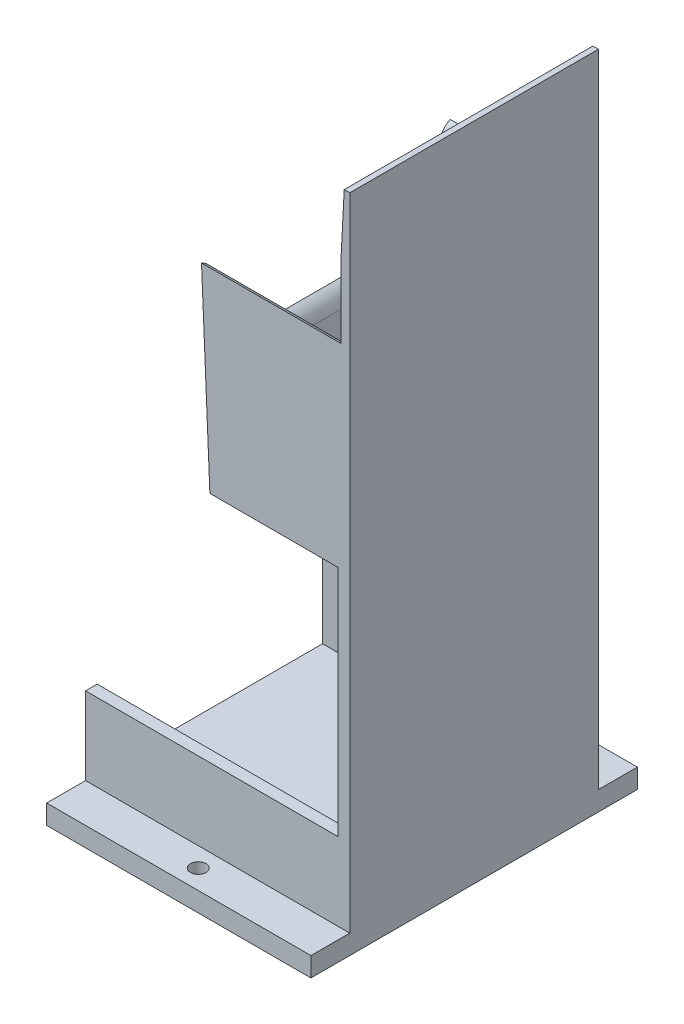
ISO-10303-21;
HEADER;
FILE_DESCRIPTION(('STEP AP214'),'2;1');
FILE_NAME('part.step','',(''),(''),'','','');
FILE_SCHEMA(('AUTOMOTIVE_DESIGN { 1 0 10303 214 1 1 1 1 }'));
ENDSEC;
DATA;
#1=APPLICATION_CONTEXT('core data for automotive mechanical design processes');
#2=APPLICATION_PROTOCOL_DEFINITION('international standard','automotive_design',2000,#1);
#3=PRODUCT_CONTEXT('',#1,'mechanical');
#4=PRODUCT('Part','Part','',(#3));
#5=PRODUCT_RELATED_PRODUCT_CATEGORY('part','',(#4));
#6=PRODUCT_DEFINITION_FORMATION('','',#4);
#7=PRODUCT_DEFINITION_CONTEXT('part definition',#1,'design');
#8=PRODUCT_DEFINITION('design','',#6,#7);
#9=PRODUCT_DEFINITION_SHAPE('','',#8);
#10=(LENGTH_UNIT() NAMED_UNIT(*) SI_UNIT(.MILLI.,.METRE.));
#11=(NAMED_UNIT(*) PLANE_ANGLE_UNIT() SI_UNIT($,.RADIAN.));
#12=(NAMED_UNIT(*) SI_UNIT($,.STERADIAN.) SOLID_ANGLE_UNIT());
#13=UNCERTAINTY_MEASURE_WITH_UNIT(LENGTH_MEASURE(1.E-05),#10,'distance_accuracy_value','');
#14=(GEOMETRIC_REPRESENTATION_CONTEXT(3) GLOBAL_UNCERTAINTY_ASSIGNED_CONTEXT((#13)) GLOBAL_UNIT_ASSIGNED_CONTEXT((#10,
#11,#12)) REPRESENTATION_CONTEXT('',''));
#15=CARTESIAN_POINT('',(0.,0.,0.));
#16=DIRECTION('',(0.,0.,1.));
#17=DIRECTION('',(1.,0.,0.));
#18=AXIS2_PLACEMENT_3D('',#15,#16,#17);
#19=CARTESIAN_POINT('',(30.8125,25.,0.));
#20=DIRECTION('',(-1.,0.,0.));
#21=DIRECTION('',(0.,0.,1.));
#22=AXIS2_PLACEMENT_3D('',#19,#20,#21);
#23=PLANE('',#22);
#24=DIRECTION('',(0.,0.,1.));
#25=VECTOR('',#24,1.);
#26=CARTESIAN_POINT('',(30.8125,25.,0.));
#27=LINE('',#26,#25);
#28=CARTESIAN_POINT('',(30.8125,25.,-29.));
#29=VERTEX_POINT('',#28);
#30=CARTESIAN_POINT('',(30.8125,25.,29.));
#31=VERTEX_POINT('',#30);
#32=EDGE_CURVE('E351',#29,#31,#27,.T.);
#33=ORIENTED_EDGE('',*,*,#32,.F.);
#34=DIRECTION('',(0.,-1.,0.));
#35=VECTOR('',#34,1.);
#36=CARTESIAN_POINT('',(30.8125,25.,-29.));
#37=LINE('',#36,#35);
#38=CARTESIAN_POINT('',(30.8125,5.,-29.));
#39=VERTEX_POINT('',#38);
#40=EDGE_CURVE('E399',#29,#39,#37,.T.);
#41=ORIENTED_EDGE('',*,*,#40,.T.);
#42=DIRECTION('',(0.,0.,-1.));
#43=VECTOR('',#42,1.);
#44=CARTESIAN_POINT('',(30.8125,5.,0.));
#45=LINE('',#44,#43);
#46=CARTESIAN_POINT('',(30.8125,5.,29.));
#47=VERTEX_POINT('',#46);
#48=EDGE_CURVE('E361',#47,#39,#45,.T.);
#49=ORIENTED_EDGE('',*,*,#48,.F.);
#50=DIRECTION('',(0.,-1.,0.));
#51=VECTOR('',#50,1.);
#52=CARTESIAN_POINT('',(30.8125,25.,29.));
#53=LINE('',#52,#51);
#54=EDGE_CURVE('E416',#31,#47,#53,.T.);
#55=ORIENTED_EDGE('',*,*,#54,.F.);
#56=EDGE_LOOP('',(#33,#41,#49,#55));
#57=FACE_BOUND('',#56,.T.);
#58=ADVANCED_FACE('F37',(#57),#23,.T.);
#59=CARTESIAN_POINT('',(0.,25.,29.));
#60=DIRECTION('',(0.,0.,-1.));
#61=DIRECTION('',(-1.,0.,0.));
#62=AXIS2_PLACEMENT_3D('',#59,#60,#61);
#63=PLANE('',#62);
#64=ORIENTED_EDGE('',*,*,#54,.T.);
#65=DIRECTION('',(1.,0.,0.));
#66=VECTOR('',#65,1.);
#67=CARTESIAN_POINT('',(0.,5.,29.));
#68=LINE('',#67,#66);
#69=CARTESIAN_POINT('',(-34.,5.,29.));
#70=VERTEX_POINT('',#69);
#71=EDGE_CURVE('E359',#70,#47,#68,.T.);
#72=ORIENTED_EDGE('',*,*,#71,.F.);
#73=DIRECTION('',(0.,1.,0.));
#74=VECTOR('',#73,1.);
#75=CARTESIAN_POINT('',(-34.,25.,29.));
#76=LINE('',#75,#74);
#77=CARTESIAN_POINT('',(-34.,25.,29.));
#78=VERTEX_POINT('',#77);
#79=EDGE_CURVE('E269',#70,#78,#76,.T.);
#80=ORIENTED_EDGE('',*,*,#79,.T.);
#81=DIRECTION('',(1.,0.,0.));
#82=VECTOR('',#81,1.);
#83=CARTESIAN_POINT('',(0.,25.,29.));
#84=LINE('',#83,#82);
#85=EDGE_CURVE('E386',#78,#31,#84,.T.);
#86=ORIENTED_EDGE('',*,*,#85,.T.);
#87=EDGE_LOOP('',(#64,#72,#80,#86));
#88=FACE_BOUND('',#87,.T.);
#89=ADVANCED_FACE('F459',(#88),#63,.T.);
#90=CARTESIAN_POINT('',(0.,25.,-29.));
#91=DIRECTION('',(0.,0.,-1.));
#92=DIRECTION('',(-1.,0.,0.));
#93=AXIS2_PLACEMENT_3D('',#90,#91,#92);
#94=PLANE('',#93);
#95=ORIENTED_EDGE('',*,*,#40,.F.);
#96=DIRECTION('',(1.,0.,0.));
#97=VECTOR('',#96,1.);
#98=CARTESIAN_POINT('',(0.,25.,-29.));
#99=LINE('',#98,#97);
#100=CARTESIAN_POINT('',(-34.,25.,-29.));
#101=VERTEX_POINT('',#100);
#102=EDGE_CURVE('E388',#101,#29,#99,.T.);
#103=ORIENTED_EDGE('',*,*,#102,.F.);
#104=DIRECTION('',(0.,-1.,0.));
#105=VECTOR('',#104,1.);
#106=CARTESIAN_POINT('',(-34.,5.,-29.));
#107=LINE('',#106,#105);
#108=CARTESIAN_POINT('',(-34.,5.,-29.));
#109=VERTEX_POINT('',#108);
#110=EDGE_CURVE('E263',#101,#109,#107,.T.);
#111=ORIENTED_EDGE('',*,*,#110,.T.);
#112=DIRECTION('',(1.,0.,0.));
#113=VECTOR('',#112,1.);
#114=CARTESIAN_POINT('',(0.,5.,-29.));
#115=LINE('',#114,#113);
#116=EDGE_CURVE('E357',#109,#39,#115,.T.);
#117=ORIENTED_EDGE('',*,*,#116,.T.);
#118=EDGE_LOOP('',(#95,#103,#111,#117));
#119=FACE_BOUND('',#118,.T.);
#120=ADVANCED_FACE('F466',(#119),#94,.F.);
#121=CARTESIAN_POINT('',(0.,25.,32.));
#122=DIRECTION('',(0.,0.,-1.));
#123=DIRECTION('',(-1.,0.,0.));
#124=AXIS2_PLACEMENT_3D('',#121,#122,#123);
#125=PLANE('',#124);
#126=DIRECTION('',(0.,1.,0.));
#127=VECTOR('',#126,1.);
#128=CARTESIAN_POINT('',(31.7861166892457,0.,32.));
#129=LINE('',#128,#127);
#130=CARTESIAN_POINT('',(31.7861166892457,135.278959734629,32.));
#131=VERTEX_POINT('',#130);
#132=CARTESIAN_POINT('',(31.7861166892457,155.,32.));
#133=VERTEX_POINT('',#132);
#134=EDGE_CURVE('E224',#131,#133,#129,.T.);
#135=ORIENTED_EDGE('',*,*,#134,.F.);
#136=DIRECTION('',(1.,0.,0.));
#137=VECTOR('',#136,1.);
#138=CARTESIAN_POINT('',(0.,135.278959734629,32.));
#139=LINE('',#138,#137);
#140=CARTESIAN_POINT('',(-4.15481256005554,135.278959734629,32.));
#141=VERTEX_POINT('',#140);
#142=EDGE_CURVE('E235',#141,#131,#139,.T.);
#143=ORIENTED_EDGE('',*,*,#142,.F.);
#144=DIRECTION('',(-0.0428178383921858,0.99908289581767,0.));
#145=VECTOR('',#144,1.);
#146=CARTESIAN_POINT('',(-5.,155.,32.));
#147=LINE('',#146,#145);
#148=CARTESIAN_POINT('',(-2.,85.,32.));
#149=VERTEX_POINT('',#148);
#150=EDGE_CURVE('E377',#149,#141,#147,.T.);
#151=ORIENTED_EDGE('',*,*,#150,.F.);
#152=DIRECTION('',(-1.,0.,0.));
#153=VECTOR('',#152,1.);
#154=CARTESIAN_POINT('',(-2.,85.,32.));
#155=LINE('',#154,#153);
#156=CARTESIAN_POINT('',(31.,85.,32.));
#157=VERTEX_POINT('',#156);
#158=EDGE_CURVE('E374',#157,#149,#155,.T.);
#159=ORIENTED_EDGE('',*,*,#158,.F.);
#160=DIRECTION('',(0.,-1.,0.));
#161=VECTOR('',#160,1.);
#162=CARTESIAN_POINT('',(31.,25.,32.));
#163=LINE('',#162,#161);
#164=CARTESIAN_POINT('',(31.,25.,32.));
#165=VERTEX_POINT('',#164);
#166=EDGE_CURVE('E354',#157,#165,#163,.T.);
#167=ORIENTED_EDGE('',*,*,#166,.T.);
#168=DIRECTION('',(1.,0.,0.));
#169=VECTOR('',#168,1.);
#170=CARTESIAN_POINT('',(0.,25.,32.));
#171=LINE('',#170,#169);
#172=CARTESIAN_POINT('',(-34.,25.,32.));
#173=VERTEX_POINT('',#172);
#174=EDGE_CURVE('E391',#173,#165,#171,.T.);
#175=ORIENTED_EDGE('',*,*,#174,.F.);
#176=DIRECTION('',(0.,-1.,0.));
#177=VECTOR('',#176,1.);
#178=CARTESIAN_POINT('',(-34.,25.,32.));
#179=LINE('',#178,#177);
#180=CARTESIAN_POINT('',(-34.,5.,32.));
#181=VERTEX_POINT('',#180);
#182=EDGE_CURVE('E402',#173,#181,#179,.T.);
#183=ORIENTED_EDGE('',*,*,#182,.T.);
#184=DIRECTION('',(1.,0.,0.));
#185=VECTOR('',#184,1.);
#186=CARTESIAN_POINT('',(0.,5.,32.));
#187=LINE('',#186,#185);
#188=CARTESIAN_POINT('',(34.,5.,32.));
#189=VERTEX_POINT('',#188);
#190=EDGE_CURVE('E284',#181,#189,#187,.T.);
#191=ORIENTED_EDGE('',*,*,#190,.T.);
#192=DIRECTION('',(0.,-1.,0.));
#193=VECTOR('',#192,1.);
#194=CARTESIAN_POINT('',(34.,25.,32.));
#195=LINE('',#194,#193);
#196=CARTESIAN_POINT('',(34.,170.,32.));
#197=VERTEX_POINT('',#196);
#198=EDGE_CURVE('E411',#197,#189,#195,.T.);
#199=ORIENTED_EDGE('',*,*,#198,.F.);
#200=DIRECTION('',(-1.,0.,0.));
#201=VECTOR('',#200,1.);
#202=CARTESIAN_POINT('',(0.,170.,32.));
#203=LINE('',#202,#201);
#204=CARTESIAN_POINT('',(32.5722333784915,170.,32.));
#205=VERTEX_POINT('',#204);
#206=EDGE_CURVE('E278',#197,#205,#203,.T.);
#207=ORIENTED_EDGE('',*,*,#206,.T.);
#208=DIRECTION('',(0.0523359562429511,0.998629534754574,0.));
#209=VECTOR('',#208,1.);
#210=CARTESIAN_POINT('',(32.5722333784915,170.,32.));
#211=LINE('',#210,#209);
#212=EDGE_CURVE('E238',#205,#133,#211,.F.);
#213=ORIENTED_EDGE('',*,*,#212,.T.);
#214=EDGE_LOOP('',(#135,#143,#151,#159,#167,#175,#183,#191,#199,#207,#213));
#215=FACE_BOUND('',#214,.T.);
#216=ADVANCED_FACE('F232',(#215),#125,.F.);
#217=CARTESIAN_POINT('',(34.,25.,0.));
#218=DIRECTION('',(-1.,0.,0.));
#219=DIRECTION('',(0.,0.,1.));
#220=AXIS2_PLACEMENT_3D('',#217,#218,#219);
#221=PLANE('',#220);
#222=DIRECTION('',(0.,-1.,0.));
#223=VECTOR('',#222,1.);
#224=CARTESIAN_POINT('',(34.,25.,-32.));
#225=LINE('',#224,#223);
#226=CARTESIAN_POINT('',(34.,170.,-32.));
#227=VERTEX_POINT('',#226);
#228=CARTESIAN_POINT('',(34.,5.,-32.));
#229=VERTEX_POINT('',#228);
#230=EDGE_CURVE('E409',#227,#229,#225,.T.);
#231=ORIENTED_EDGE('',*,*,#230,.F.);
#232=DIRECTION('',(0.,0.,1.));
#233=VECTOR('',#232,1.);
#234=CARTESIAN_POINT('',(34.,170.,0.));
#235=LINE('',#234,#233);
#236=EDGE_CURVE('E275',#227,#197,#235,.T.);
#237=ORIENTED_EDGE('',*,*,#236,.T.);
#238=ORIENTED_EDGE('',*,*,#198,.T.);
#239=DIRECTION('',(0.,0.,1.));
#240=VECTOR('',#239,1.);
#241=CARTESIAN_POINT('',(34.,5.,0.));
#242=LINE('',#241,#240);
#243=CARTESIAN_POINT('',(34.,5.,42.));
#244=VERTEX_POINT('',#243);
#245=EDGE_CURVE('E281',#189,#244,#242,.T.);
#246=ORIENTED_EDGE('',*,*,#245,.T.);
#247=DIRECTION('',(0.,-1.,0.));
#248=VECTOR('',#247,1.);
#249=CARTESIAN_POINT('',(34.,5.,42.));
#250=LINE('',#249,#248);
#251=CARTESIAN_POINT('',(34.,0.,42.));
#252=VERTEX_POINT('',#251);
#253=EDGE_CURVE('E297',#244,#252,#250,.T.);
#254=ORIENTED_EDGE('',*,*,#253,.T.);
#255=DIRECTION('',(0.,0.,-1.));
#256=VECTOR('',#255,1.);
#257=CARTESIAN_POINT('',(34.,0.,0.));
#258=LINE('',#257,#256);
#259=CARTESIAN_POINT('',(34.,0.,-42.));
#260=VERTEX_POINT('',#259);
#261=EDGE_CURVE('E385',#252,#260,#258,.T.);
#262=ORIENTED_EDGE('',*,*,#261,.T.);
#263=DIRECTION('',(0.,-1.,0.));
#264=VECTOR('',#263,1.);
#265=CARTESIAN_POINT('',(34.,5.,-42.));
#266=LINE('',#265,#264);
#267=CARTESIAN_POINT('',(34.,5.,-42.));
#268=VERTEX_POINT('',#267);
#269=EDGE_CURVE('E323',#268,#260,#266,.T.);
#270=ORIENTED_EDGE('',*,*,#269,.F.);
#271=DIRECTION('',(0.,0.,-1.));
#272=VECTOR('',#271,1.);
#273=CARTESIAN_POINT('',(34.,5.,0.));
#274=LINE('',#273,#272);
#275=EDGE_CURVE('E321',#229,#268,#274,.T.);
#276=ORIENTED_EDGE('',*,*,#275,.F.);
#277=EDGE_LOOP('',(#231,#237,#238,#246,#254,#262,#270,#276));
#278=FACE_BOUND('',#277,.T.);
#279=ADVANCED_FACE('F480',(#278),#221,.F.);
#280=CARTESIAN_POINT('',(0.,25.,-32.));
#281=DIRECTION('',(0.,0.,-1.));
#282=DIRECTION('',(-1.,0.,0.));
#283=AXIS2_PLACEMENT_3D('',#280,#281,#282);
#284=PLANE('',#283);
#285=DIRECTION('',(-1.,0.,0.));
#286=VECTOR('',#285,1.);
#287=CARTESIAN_POINT('',(0.,135.278959734629,-32.));
#288=LINE('',#287,#286);
#289=CARTESIAN_POINT('',(31.7861166892457,135.278959734629,-32.));
#290=VERTEX_POINT('',#289);
#291=CARTESIAN_POINT('',(-4.15481256005554,135.278959734629,-32.));
#292=VERTEX_POINT('',#291);
#293=EDGE_CURVE('E252',#290,#292,#288,.T.);
#294=ORIENTED_EDGE('',*,*,#293,.F.);
#295=DIRECTION('',(0.,-1.,0.));
#296=VECTOR('',#295,1.);
#297=CARTESIAN_POINT('',(31.7861166892457,25.,-32.));
#298=LINE('',#297,#296);
#299=CARTESIAN_POINT('',(31.7861166892457,155.,-32.));
#300=VERTEX_POINT('',#299);
#301=EDGE_CURVE('E227',#300,#290,#298,.T.);
#302=ORIENTED_EDGE('',*,*,#301,.F.);
#303=DIRECTION('',(-0.0523359562429511,-0.998629534754574,0.));
#304=VECTOR('',#303,1.);
#305=CARTESIAN_POINT('',(24.9047027403173,23.6947998356755,-32.));
#306=LINE('',#305,#304);
#307=CARTESIAN_POINT('',(32.5722333784915,170.,-32.));
#308=VERTEX_POINT('',#307);
#309=EDGE_CURVE('E429',#300,#308,#306,.F.);
#310=ORIENTED_EDGE('',*,*,#309,.T.);
#311=DIRECTION('',(-1.,0.,0.));
#312=VECTOR('',#311,1.);
#313=CARTESIAN_POINT('',(36.,170.,-32.));
#314=LINE('',#313,#312);
#315=EDGE_CURVE('E272',#227,#308,#314,.T.);
#316=ORIENTED_EDGE('',*,*,#315,.F.);
#317=ORIENTED_EDGE('',*,*,#230,.T.);
#318=DIRECTION('',(1.,0.,0.));
#319=VECTOR('',#318,1.);
#320=CARTESIAN_POINT('',(0.,5.,-32.));
#321=LINE('',#320,#319);
#322=CARTESIAN_POINT('',(-34.,5.,-32.));
#323=VERTEX_POINT('',#322);
#324=EDGE_CURVE('E318',#323,#229,#321,.T.);
#325=ORIENTED_EDGE('',*,*,#324,.F.);
#326=DIRECTION('',(0.,-1.,0.));
#327=VECTOR('',#326,1.);
#328=CARTESIAN_POINT('',(-34.,25.,-32.));
#329=LINE('',#328,#327);
#330=CARTESIAN_POINT('',(-34.,25.,-32.));
#331=VERTEX_POINT('',#330);
#332=EDGE_CURVE('E405',#331,#323,#329,.T.);
#333=ORIENTED_EDGE('',*,*,#332,.F.);
#334=DIRECTION('',(1.,0.,0.));
#335=VECTOR('',#334,1.);
#336=CARTESIAN_POINT('',(0.,25.,-32.));
#337=LINE('',#336,#335);
#338=CARTESIAN_POINT('',(31.,25.,-32.));
#339=VERTEX_POINT('',#338);
#340=EDGE_CURVE('E393',#331,#339,#337,.T.);
#341=ORIENTED_EDGE('',*,*,#340,.T.);
#342=DIRECTION('',(0.,-1.,0.));
#343=VECTOR('',#342,1.);
#344=CARTESIAN_POINT('',(31.,25.,-32.));
#345=LINE('',#344,#343);
#346=CARTESIAN_POINT('',(31.,85.,-32.));
#347=VERTEX_POINT('',#346);
#348=EDGE_CURVE('E333',#347,#339,#345,.T.);
#349=ORIENTED_EDGE('',*,*,#348,.F.);
#350=DIRECTION('',(1.,0.,0.));
#351=VECTOR('',#350,1.);
#352=CARTESIAN_POINT('',(0.,85.,-32.));
#353=LINE('',#352,#351);
#354=CARTESIAN_POINT('',(-2.,85.,-32.));
#355=VERTEX_POINT('',#354);
#356=EDGE_CURVE('E365',#355,#347,#353,.T.);
#357=ORIENTED_EDGE('',*,*,#356,.F.);
#358=DIRECTION('',(0.0428178383921858,-0.99908289581767,0.));
#359=VECTOR('',#358,1.);
#360=CARTESIAN_POINT('',(1.63984518231819,0.0702790792422083,-32.));
#361=LINE('',#360,#359);
#362=EDGE_CURVE('E367',#292,#355,#361,.T.);
#363=ORIENTED_EDGE('',*,*,#362,.F.);
#364=EDGE_LOOP('',(#294,#302,#310,#316,#317,#325,#333,#341,#349,#357,#363));
#365=FACE_BOUND('',#364,.T.);
#366=ADVANCED_FACE('F473',(#365),#284,.T.);
#367=CARTESIAN_POINT('',(30.8125,130.696384039674,34.));
#368=DIRECTION('',(-1.,0.,0.));
#369=DIRECTION('',(0.,0.,1.));
#370=AXIS2_PLACEMENT_3D('',#367,#368,#369);
#371=CIRCLE('',#370,5.);
#372=CARTESIAN_POINT('',(30.8125,130.696384039674,29.));
#373=VERTEX_POINT('',#372);
#374=CARTESIAN_POINT('',(30.8125,132.314463582687,29.269057325175));
#375=VERTEX_POINT('',#374);
#376=EDGE_CURVE('E52',#373,#375,#371,.F.);
#377=ORIENTED_EDGE('',*,*,#376,.T.);
#378=DIRECTION('',(0.,0.,-1.));
#379=VECTOR('',#378,1.);
#380=CARTESIAN_POINT('',(30.8125,132.314463582687,-29.));
#381=LINE('',#380,#379);
#382=CARTESIAN_POINT('',(30.8125,132.314463582687,-29.269057325175));
#383=VERTEX_POINT('',#382);
#384=EDGE_CURVE('E59',#375,#383,#381,.T.);
#385=ORIENTED_EDGE('',*,*,#384,.T.);
#386=CARTESIAN_POINT('',(30.8125,130.696384039674,-34.));
#387=DIRECTION('',(-1.,0.,0.));
#388=DIRECTION('',(0.,0.,1.));
#389=AXIS2_PLACEMENT_3D('',#386,#387,#388);
#390=CIRCLE('',#389,5.);
#391=CARTESIAN_POINT('',(30.8125,130.696384039674,-29.));
#392=VERTEX_POINT('',#391);
#393=EDGE_CURVE('E11',#383,#392,#390,.F.);
#394=ORIENTED_EDGE('',*,*,#393,.T.);
#395=CARTESIAN_POINT('',(30.8125,85.,-29.));
#396=VERTEX_POINT('',#395);
#397=EDGE_CURVE('E414',#392,#396,#37,.T.);
#398=ORIENTED_EDGE('',*,*,#397,.T.);
#399=DIRECTION('',(0.,0.,-1.));
#400=VECTOR('',#399,1.);
#401=CARTESIAN_POINT('',(30.8125,85.,0.));
#402=LINE('',#401,#400);
#403=CARTESIAN_POINT('',(30.8125,85.,29.));
#404=VERTEX_POINT('',#403);
#405=EDGE_CURVE('E345',#404,#396,#402,.T.);
#406=ORIENTED_EDGE('',*,*,#405,.F.);
#407=EDGE_CURVE('E406',#373,#404,#53,.T.);
#408=ORIENTED_EDGE('',*,*,#407,.F.);
#409=EDGE_LOOP('',(#377,#385,#394,#398,#406,#408));
#410=FACE_BOUND('',#409,.T.);
#411=ADVANCED_FACE('F462',(#410),#23,.T.);
#412=DIRECTION('',(-0.0428178383921859,0.99908289581767,0.));
#413=VECTOR('',#412,1.);
#414=CARTESIAN_POINT('',(-5.,155.,29.));
#415=LINE('',#414,#413);
#416=CARTESIAN_POINT('',(-3.28728646431256,115.036684167293,29.));
#417=VERTEX_POINT('',#416);
#418=CARTESIAN_POINT('',(-3.95841645884315,130.696384039674,29.));
#419=VERTEX_POINT('',#418);
#420=EDGE_CURVE('E260',#417,#419,#415,.T.);
#421=ORIENTED_EDGE('',*,*,#420,.T.);
#422=DIRECTION('',(-1.,0.,0.));
#423=VECTOR('',#422,1.);
#424=CARTESIAN_POINT('',(30.8125,130.696384039674,29.));
#425=LINE('',#424,#423);
#426=EDGE_CURVE('E442',#419,#373,#425,.F.);
#427=ORIENTED_EDGE('',*,*,#426,.T.);
#428=ORIENTED_EDGE('',*,*,#407,.T.);
#429=DIRECTION('',(1.,0.,0.));
#430=VECTOR('',#429,1.);
#431=CARTESIAN_POINT('',(0.,85.,29.));
#432=LINE('',#431,#430);
#433=CARTESIAN_POINT('',(0.,85.,29.));
#434=VERTEX_POINT('',#433);
#435=EDGE_CURVE('E348',#434,#404,#432,.T.);
#436=ORIENTED_EDGE('',*,*,#435,.F.);
#437=DIRECTION('',(0.,1.,0.));
#438=VECTOR('',#437,1.);
#439=CARTESIAN_POINT('',(0.,0.,29.));
#440=LINE('',#439,#438);
#441=CARTESIAN_POINT('',(0.,97.7274934341638,29.));
#442=VERTEX_POINT('',#441);
#443=EDGE_CURVE('E364',#434,#442,#440,.T.);
#444=ORIENTED_EDGE('',*,*,#443,.T.);
#445=DIRECTION('',(0.034899496702498,-0.999390827019096,0.));
#446=VECTOR('',#445,1.);
#447=CARTESIAN_POINT('',(0.,97.7274934341638,29.));
#448=LINE('',#447,#446);
#449=CARTESIAN_POINT('',(-0.453119909941051,110.703149942769,29.));
#450=VERTEX_POINT('',#449);
#451=EDGE_CURVE('E420',#442,#450,#448,.F.);
#452=ORIENTED_EDGE('',*,*,#451,.T.);
#453=CARTESIAN_POINT('',(-5.45007404503653,110.528652459256,29.));
#454=DIRECTION('',(0.,0.,-1.));
#455=DIRECTION('',(-1.,0.,0.));
#456=AXIS2_PLACEMENT_3D('',#453,#454,#455);
#457=CIRCLE('',#456,5.);
#458=EDGE_CURVE('E437',#450,#417,#457,.F.);
#459=ORIENTED_EDGE('',*,*,#458,.T.);
#460=EDGE_LOOP('',(#421,#427,#428,#436,#444,#452,#459));
#461=FACE_BOUND('',#460,.T.);
#462=ADVANCED_FACE('F469',(#461),#63,.T.);
#463=ORIENTED_EDGE('',*,*,#397,.F.);
#464=DIRECTION('',(1.,0.,0.));
#465=VECTOR('',#464,1.);
#466=CARTESIAN_POINT('',(0.,130.696384039674,-29.));
#467=LINE('',#466,#465);
#468=CARTESIAN_POINT('',(-3.95841645884315,130.696384039674,-29.));
#469=VERTEX_POINT('',#468);
#470=EDGE_CURVE('E444',#392,#469,#467,.F.);
#471=ORIENTED_EDGE('',*,*,#470,.T.);
#472=DIRECTION('',(0.0428178383921859,-0.99908289581767,0.));
#473=VECTOR('',#472,1.);
#474=CARTESIAN_POINT('',(-3.28728646431256,115.036684167293,-29.));
#475=LINE('',#474,#473);
#476=CARTESIAN_POINT('',(-3.28728646431256,115.036684167293,-29.));
#477=VERTEX_POINT('',#476);
#478=EDGE_CURVE('E255',#469,#477,#475,.T.);
#479=ORIENTED_EDGE('',*,*,#478,.T.);
#480=CARTESIAN_POINT('',(-5.45007404503653,110.528652459256,-29.));
#481=DIRECTION('',(0.,0.,-1.));
#482=DIRECTION('',(-1.,0.,0.));
#483=AXIS2_PLACEMENT_3D('',#480,#481,#482);
#484=CIRCLE('',#483,5.);
#485=CARTESIAN_POINT('',(-0.453119909941051,110.703149942769,-29.));
#486=VERTEX_POINT('',#485);
#487=EDGE_CURVE('E435',#477,#486,#484,.T.);
#488=ORIENTED_EDGE('',*,*,#487,.T.);
#489=DIRECTION('',(-0.034899496702498,0.999390827019096,0.));
#490=VECTOR('',#489,1.);
#491=CARTESIAN_POINT('',(2.53660674310793,25.0885802593673,-29.));
#492=LINE('',#491,#490);
#493=CARTESIAN_POINT('',(0.,97.7274934341638,-29.));
#494=VERTEX_POINT('',#493);
#495=EDGE_CURVE('E423',#486,#494,#492,.F.);
#496=ORIENTED_EDGE('',*,*,#495,.T.);
#497=DIRECTION('',(0.,-1.,0.));
#498=VECTOR('',#497,1.);
#499=CARTESIAN_POINT('',(0.,185.,-29.));
#500=LINE('',#499,#498);
#501=CARTESIAN_POINT('',(0.,85.,-29.));
#502=VERTEX_POINT('',#501);
#503=EDGE_CURVE('E382',#494,#502,#500,.T.);
#504=ORIENTED_EDGE('',*,*,#503,.T.);
#505=DIRECTION('',(1.,0.,0.));
#506=VECTOR('',#505,1.);
#507=CARTESIAN_POINT('',(0.,85.,-29.));
#508=LINE('',#507,#506);
#509=EDGE_CURVE('E340',#502,#396,#508,.T.);
#510=ORIENTED_EDGE('',*,*,#509,.T.);
#511=EDGE_LOOP('',(#463,#471,#479,#488,#496,#504,#510));
#512=FACE_BOUND('',#511,.T.);
#513=ADVANCED_FACE('F478',(#512),#94,.F.);
#514=CARTESIAN_POINT('',(-34.,25.,0.));
#515=DIRECTION('',(-1.,0.,0.));
#516=DIRECTION('',(0.,0.,1.));
#517=AXIS2_PLACEMENT_3D('',#514,#515,#516);
#518=PLANE('',#517);
#519=ORIENTED_EDGE('',*,*,#110,.F.);
#520=DIRECTION('',(0.,0.,-1.));
#521=VECTOR('',#520,1.);
#522=CARTESIAN_POINT('',(-34.,25.,0.));
#523=LINE('',#522,#521);
#524=EDGE_CURVE('E395',#101,#331,#523,.T.);
#525=ORIENTED_EDGE('',*,*,#524,.T.);
#526=ORIENTED_EDGE('',*,*,#332,.T.);
#527=DIRECTION('',(0.,0.,1.));
#528=VECTOR('',#527,1.);
#529=CARTESIAN_POINT('',(-34.,5.,0.));
#530=LINE('',#529,#528);
#531=CARTESIAN_POINT('',(-34.,5.,-42.));
#532=VERTEX_POINT('',#531);
#533=EDGE_CURVE('E315',#532,#323,#530,.T.);
#534=ORIENTED_EDGE('',*,*,#533,.F.);
#535=DIRECTION('',(0.,-1.,0.));
#536=VECTOR('',#535,1.);
#537=CARTESIAN_POINT('',(-34.,5.,-42.));
#538=LINE('',#537,#536);
#539=CARTESIAN_POINT('',(-34.,0.,-42.));
#540=VERTEX_POINT('',#539);
#541=EDGE_CURVE('E330',#532,#540,#538,.T.);
#542=ORIENTED_EDGE('',*,*,#541,.T.);
#543=DIRECTION('',(0.,0.,-1.));
#544=VECTOR('',#543,1.);
#545=CARTESIAN_POINT('',(-34.,0.,0.));
#546=LINE('',#545,#544);
#547=CARTESIAN_POINT('',(-34.,0.,42.));
#548=VERTEX_POINT('',#547);
#549=EDGE_CURVE('E389',#548,#540,#546,.T.);
#550=ORIENTED_EDGE('',*,*,#549,.F.);
#551=DIRECTION('',(0.,-1.,0.));
#552=VECTOR('',#551,1.);
#553=CARTESIAN_POINT('',(-34.,5.,42.));
#554=LINE('',#553,#552);
#555=CARTESIAN_POINT('',(-34.,5.,42.));
#556=VERTEX_POINT('',#555);
#557=EDGE_CURVE('E304',#556,#548,#554,.T.);
#558=ORIENTED_EDGE('',*,*,#557,.F.);
#559=DIRECTION('',(0.,0.,-1.));
#560=VECTOR('',#559,1.);
#561=CARTESIAN_POINT('',(-34.,5.,0.));
#562=LINE('',#561,#560);
#563=EDGE_CURVE('E288',#556,#181,#562,.T.);
#564=ORIENTED_EDGE('',*,*,#563,.T.);
#565=ORIENTED_EDGE('',*,*,#182,.F.);
#566=EDGE_CURVE('E396',#173,#78,#523,.T.);
#567=ORIENTED_EDGE('',*,*,#566,.T.);
#568=ORIENTED_EDGE('',*,*,#79,.F.);
#569=DIRECTION('',(0.,0.,1.));
#570=VECTOR('',#569,1.);
#571=CARTESIAN_POINT('',(-34.,5.,29.));
#572=LINE('',#571,#570);
#573=EDGE_CURVE('E266',#109,#70,#572,.T.);
#574=ORIENTED_EDGE('',*,*,#573,.F.);
#575=EDGE_LOOP('',(#519,#525,#526,#534,#542,#550,#558,#564,#565,#567,#568,#574));
#576=FACE_BOUND('',#575,.T.);
#577=ADVANCED_FACE('F529',(#576),#518,.T.);
#578=CARTESIAN_POINT('',(0.,25.,0.));
#579=DIRECTION('',(0.,1.,0.));
#580=DIRECTION('',(0.,0.,1.));
#581=AXIS2_PLACEMENT_3D('',#578,#579,#580);
#582=PLANE('',#581);
#583=ORIENTED_EDGE('',*,*,#524,.F.);
#584=ORIENTED_EDGE('',*,*,#102,.T.);
#585=ORIENTED_EDGE('',*,*,#32,.T.);
#586=ORIENTED_EDGE('',*,*,#85,.F.);
#587=ORIENTED_EDGE('',*,*,#566,.F.);
#588=ORIENTED_EDGE('',*,*,#174,.T.);
#589=DIRECTION('',(0.,0.,-1.));
#590=VECTOR('',#589,1.);
#591=CARTESIAN_POINT('',(31.,25.,58.));
#592=LINE('',#591,#590);
#593=EDGE_CURVE('E337',#165,#339,#592,.T.);
#594=ORIENTED_EDGE('',*,*,#593,.T.);
#595=ORIENTED_EDGE('',*,*,#340,.F.);
#596=EDGE_LOOP('',(#583,#584,#585,#586,#587,#588,#594,#595));
#597=FACE_BOUND('',#596,.T.);
#598=ADVANCED_FACE('F525',(#597),#582,.T.);
#599=CARTESIAN_POINT('',(0.,0.,0.));
#600=DIRECTION('',(0.,1.,0.));
#601=DIRECTION('',(0.,0.,1.));
#602=AXIS2_PLACEMENT_3D('',#599,#600,#601);
#603=PLANE('',#602);
#604=ORIENTED_EDGE('',*,*,#261,.F.);
#605=DIRECTION('',(-1.,0.,0.));
#606=VECTOR('',#605,1.);
#607=CARTESIAN_POINT('',(0.,0.,42.));
#608=LINE('',#607,#606);
#609=EDGE_CURVE('E280',#252,#548,#608,.T.);
#610=ORIENTED_EDGE('',*,*,#609,.T.);
#611=ORIENTED_EDGE('',*,*,#549,.T.);
#612=DIRECTION('',(-1.,0.,0.));
#613=VECTOR('',#612,1.);
#614=CARTESIAN_POINT('',(0.,0.,-42.));
#615=LINE('',#614,#613);
#616=EDGE_CURVE('E312',#260,#540,#615,.T.);
#617=ORIENTED_EDGE('',*,*,#616,.F.);
#618=EDGE_LOOP('',(#604,#610,#611,#617));
#619=FACE_BOUND('',#618,.T.);
#620=CARTESIAN_POINT('',(0.,0.,-37.));
#621=DIRECTION('',(0.,1.,0.));
#622=DIRECTION('',(0.,0.,1.));
#623=AXIS2_PLACEMENT_3D('',#620,#621,#622);
#624=CIRCLE('',#623,2.);
#625=CARTESIAN_POINT('',(0.,0.,-35.));
#626=VERTEX_POINT('',#625);
#627=EDGE_CURVE('E307',#626,#626,#624,.T.);
#628=ORIENTED_EDGE('',*,*,#627,.T.);
#629=EDGE_LOOP('',(#628));
#630=FACE_BOUND('',#629,.T.);
#631=CARTESIAN_POINT('',(0.,0.,37.));
#632=DIRECTION('',(0.,1.,0.));
#633=DIRECTION('',(0.,0.,1.));
#634=AXIS2_PLACEMENT_3D('',#631,#632,#633);
#635=CIRCLE('',#634,2.);
#636=CARTESIAN_POINT('',(0.,0.,39.));
#637=VERTEX_POINT('',#636);
#638=EDGE_CURVE('E285',#637,#637,#635,.F.);
#639=ORIENTED_EDGE('',*,*,#638,.F.);
#640=EDGE_LOOP('',(#639));
#641=FACE_BOUND('',#640,.T.);
#642=ADVANCED_FACE('F577',(#619,#630,#641),#603,.F.);
#643=CARTESIAN_POINT('',(-5.,155.,32.));
#644=DIRECTION('',(-0.99908289581767,-0.0428178383921858,0.));
#645=DIRECTION('',(0.0428178383921858,-0.99908289581767,0.));
#646=AXIS2_PLACEMENT_3D('',#643,#644,#645);
#647=PLANE('',#646);
#648=ORIENTED_EDGE('',*,*,#150,.T.);
#649=CARTESIAN_POINT('',(-3.95841645884315,130.696384039674,34.));
#650=DIRECTION('',(-0.99908289581767,-0.0428178383921858,0.));
#651=DIRECTION('',(0.0428178383921858,-0.99908289581767,0.));
#652=AXIS2_PLACEMENT_3D('',#649,#650,#651);
#653=ELLIPSE('',#652,5.00458973017239,5.);
#654=EDGE_CURVE('E248',#141,#419,#653,.T.);
#655=ORIENTED_EDGE('',*,*,#654,.T.);
#656=ORIENTED_EDGE('',*,*,#420,.F.);
#657=DIRECTION('',(0.,0.,1.));
#658=VECTOR('',#657,1.);
#659=CARTESIAN_POINT('',(-3.28728646431256,115.036684167293,29.));
#660=LINE('',#659,#658);
#661=EDGE_CURVE('E257',#477,#417,#660,.T.);
#662=ORIENTED_EDGE('',*,*,#661,.F.);
#663=ORIENTED_EDGE('',*,*,#478,.F.);
#664=CARTESIAN_POINT('',(-3.95841645884315,130.696384039674,-34.));
#665=DIRECTION('',(-0.99908289581767,-0.0428178383921858,0.));
#666=DIRECTION('',(0.0428178383921858,-0.99908289581767,0.));
#667=AXIS2_PLACEMENT_3D('',#664,#665,#666);
#668=ELLIPSE('',#667,5.00458973017239,5.);
#669=EDGE_CURVE('E439',#469,#292,#668,.T.);
#670=ORIENTED_EDGE('',*,*,#669,.T.);
#671=ORIENTED_EDGE('',*,*,#362,.T.);
#672=DIRECTION('',(0.,0.,-1.));
#673=VECTOR('',#672,1.);
#674=CARTESIAN_POINT('',(-2.,85.,32.));
#675=LINE('',#674,#673);
#676=EDGE_CURVE('E379',#149,#355,#675,.T.);
#677=ORIENTED_EDGE('',*,*,#676,.F.);
#678=EDGE_LOOP('',(#648,#655,#656,#662,#663,#670,#671,#677));
#679=FACE_BOUND('',#678,.T.);
#680=ADVANCED_FACE('F489',(#679),#647,.T.);
#681=CARTESIAN_POINT('',(-2.,85.,32.));
#682=DIRECTION('',(0.,-1.,0.));
#683=DIRECTION('',(0.,0.,-1.));
#684=AXIS2_PLACEMENT_3D('',#681,#682,#683);
#685=PLANE('',#684);
#686=ORIENTED_EDGE('',*,*,#509,.F.);
#687=DIRECTION('',(0.,0.,1.));
#688=VECTOR('',#687,1.);
#689=CARTESIAN_POINT('',(0.,85.,-32.));
#690=LINE('',#689,#688);
#691=EDGE_CURVE('E369',#502,#434,#690,.T.);
#692=ORIENTED_EDGE('',*,*,#691,.T.);
#693=ORIENTED_EDGE('',*,*,#435,.T.);
#694=ORIENTED_EDGE('',*,*,#405,.T.);
#695=EDGE_LOOP('',(#686,#692,#693,#694));
#696=FACE_BOUND('',#695,.T.);
#697=ORIENTED_EDGE('',*,*,#676,.T.);
#698=ORIENTED_EDGE('',*,*,#356,.T.);
#699=DIRECTION('',(0.,0.,-1.));
#700=VECTOR('',#699,1.);
#701=CARTESIAN_POINT('',(31.,85.,58.));
#702=LINE('',#701,#700);
#703=EDGE_CURVE('E336',#157,#347,#702,.T.);
#704=ORIENTED_EDGE('',*,*,#703,.F.);
#705=ORIENTED_EDGE('',*,*,#158,.T.);
#706=EDGE_LOOP('',(#697,#698,#704,#705));
#707=FACE_BOUND('',#706,.T.);
#708=ADVANCED_FACE('F507',(#696,#707),#685,.T.);
#709=CARTESIAN_POINT('',(0.,0.,-32.));
#710=DIRECTION('',(1.,0.,0.));
#711=DIRECTION('',(0.,0.,-1.));
#712=AXIS2_PLACEMENT_3D('',#709,#710,#711);
#713=PLANE('',#712);
#714=ORIENTED_EDGE('',*,*,#503,.F.);
#715=DIRECTION('',(0.,0.,1.));
#716=VECTOR('',#715,1.);
#717=CARTESIAN_POINT('',(0.,97.7274934341638,-32.));
#718=LINE('',#717,#716);
#719=EDGE_CURVE('E413',#494,#442,#718,.T.);
#720=ORIENTED_EDGE('',*,*,#719,.T.);
#721=ORIENTED_EDGE('',*,*,#443,.F.);
#722=ORIENTED_EDGE('',*,*,#691,.F.);
#723=EDGE_LOOP('',(#714,#720,#721,#722));
#724=FACE_BOUND('',#723,.T.);
#725=ADVANCED_FACE('F504',(#724),#713,.T.);
#726=CARTESIAN_POINT('',(0.,97.7274934341638,-32.));
#727=DIRECTION('',(-0.999390827019096,-0.0348994967024979,0.));
#728=DIRECTION('',(0.,0.,1.));
#729=AXIS2_PLACEMENT_3D('',#726,#727,#728);
#730=PLANE('',#729);
#731=ORIENTED_EDGE('',*,*,#495,.F.);
#732=DIRECTION('',(0.,0.,-1.));
#733=VECTOR('',#732,1.);
#734=CARTESIAN_POINT('',(-0.453119909941051,110.703149942769,29.));
#735=LINE('',#734,#733);
#736=EDGE_CURVE('E433',#486,#450,#735,.F.);
#737=ORIENTED_EDGE('',*,*,#736,.T.);
#738=ORIENTED_EDGE('',*,*,#451,.F.);
#739=ORIENTED_EDGE('',*,*,#719,.F.);
#740=EDGE_LOOP('',(#731,#737,#738,#739));
#741=FACE_BOUND('',#740,.T.);
#742=ADVANCED_FACE('F501',(#741),#730,.F.);
#743=CARTESIAN_POINT('',(0.,5.,0.));
#744=DIRECTION('',(0.,1.,0.));
#745=DIRECTION('',(0.,0.,1.));
#746=AXIS2_PLACEMENT_3D('',#743,#744,#745);
#747=PLANE('',#746);
#748=ORIENTED_EDGE('',*,*,#48,.T.);
#749=ORIENTED_EDGE('',*,*,#116,.F.);
#750=ORIENTED_EDGE('',*,*,#573,.T.);
#751=ORIENTED_EDGE('',*,*,#71,.T.);
#752=EDGE_LOOP('',(#748,#749,#750,#751));
#753=FACE_BOUND('',#752,.T.);
#754=ADVANCED_FACE('F562',(#753),#747,.T.);
#755=CARTESIAN_POINT('',(31.,25.,58.));
#756=DIRECTION('',(1.,0.,0.));
#757=DIRECTION('',(0.,0.,-1.));
#758=AXIS2_PLACEMENT_3D('',#755,#756,#757);
#759=PLANE('',#758);
#760=ORIENTED_EDGE('',*,*,#703,.T.);
#761=ORIENTED_EDGE('',*,*,#348,.T.);
#762=ORIENTED_EDGE('',*,*,#593,.F.);
#763=ORIENTED_EDGE('',*,*,#166,.F.);
#764=EDGE_LOOP('',(#760,#761,#762,#763));
#765=FACE_BOUND('',#764,.T.);
#766=ADVANCED_FACE('F519',(#765),#759,.F.);
#767=CARTESIAN_POINT('',(0.,5.,-42.));
#768=DIRECTION('',(0.,0.,1.));
#769=DIRECTION('',(1.,0.,0.));
#770=AXIS2_PLACEMENT_3D('',#767,#768,#769);
#771=PLANE('',#770);
#772=ORIENTED_EDGE('',*,*,#616,.T.);
#773=ORIENTED_EDGE('',*,*,#541,.F.);
#774=DIRECTION('',(-1.,0.,0.));
#775=VECTOR('',#774,1.);
#776=CARTESIAN_POINT('',(0.,5.,-42.));
#777=LINE('',#776,#775);
#778=EDGE_CURVE('E311',#268,#532,#777,.T.);
#779=ORIENTED_EDGE('',*,*,#778,.F.);
#780=ORIENTED_EDGE('',*,*,#269,.T.);
#781=EDGE_LOOP('',(#772,#773,#779,#780));
#782=FACE_BOUND('',#781,.T.);
#783=ADVANCED_FACE('F569',(#782),#771,.F.);
#784=CARTESIAN_POINT('',(0.,5.,-37.));
#785=DIRECTION('',(0.,-1.,0.));
#786=DIRECTION('',(0.,0.,-1.));
#787=AXIS2_PLACEMENT_3D('',#784,#785,#786);
#788=CYLINDRICAL_SURFACE('',#787,2.);
#789=CARTESIAN_POINT('',(0.,5.,-37.));
#790=DIRECTION('',(0.,1.,0.));
#791=DIRECTION('',(0.,0.,1.));
#792=AXIS2_PLACEMENT_3D('',#789,#790,#791);
#793=CIRCLE('',#792,2.);
#794=CARTESIAN_POINT('',(0.,5.,-35.));
#795=VERTEX_POINT('',#794);
#796=EDGE_CURVE('E308',#795,#795,#793,.T.);
#797=ORIENTED_EDGE('',*,*,#796,.T.);
#798=EDGE_LOOP('',(#797));
#799=FACE_BOUND('',#798,.T.);
#800=ORIENTED_EDGE('',*,*,#627,.F.);
#801=EDGE_LOOP('',(#800));
#802=FACE_BOUND('',#801,.T.);
#803=ADVANCED_FACE('F714',(#799,#802),#788,.F.);
#804=CARTESIAN_POINT('',(0.,5.,0.));
#805=DIRECTION('',(0.,1.,0.));
#806=DIRECTION('',(0.,0.,1.));
#807=AXIS2_PLACEMENT_3D('',#804,#805,#806);
#808=PLANE('',#807);
#809=ORIENTED_EDGE('',*,*,#796,.F.);
#810=EDGE_LOOP('',(#809));
#811=FACE_BOUND('',#810,.T.);
#812=ORIENTED_EDGE('',*,*,#778,.T.);
#813=ORIENTED_EDGE('',*,*,#533,.T.);
#814=ORIENTED_EDGE('',*,*,#324,.T.);
#815=ORIENTED_EDGE('',*,*,#275,.T.);
#816=EDGE_LOOP('',(#812,#813,#814,#815));
#817=FACE_BOUND('',#816,.T.);
#818=ADVANCED_FACE('F551',(#811,#817),#808,.T.);
#819=CARTESIAN_POINT('',(0.,5.,42.));
#820=DIRECTION('',(0.,0.,1.));
#821=DIRECTION('',(1.,0.,0.));
#822=AXIS2_PLACEMENT_3D('',#819,#820,#821);
#823=PLANE('',#822);
#824=ORIENTED_EDGE('',*,*,#609,.F.);
#825=ORIENTED_EDGE('',*,*,#253,.F.);
#826=DIRECTION('',(-1.,0.,0.));
#827=VECTOR('',#826,1.);
#828=CARTESIAN_POINT('',(0.,5.,42.));
#829=LINE('',#828,#827);
#830=EDGE_CURVE('E291',#244,#556,#829,.T.);
#831=ORIENTED_EDGE('',*,*,#830,.T.);
#832=ORIENTED_EDGE('',*,*,#557,.T.);
#833=EDGE_LOOP('',(#824,#825,#831,#832));
#834=FACE_BOUND('',#833,.T.);
#835=ADVANCED_FACE('F539',(#834),#823,.T.);
#836=CARTESIAN_POINT('',(0.,5.,37.));
#837=DIRECTION('',(0.,-1.,0.));
#838=DIRECTION('',(0.,0.,-1.));
#839=AXIS2_PLACEMENT_3D('',#836,#837,#838);
#840=CYLINDRICAL_SURFACE('',#839,2.);
#841=CARTESIAN_POINT('',(0.,5.,37.));
#842=DIRECTION('',(0.,1.,0.));
#843=DIRECTION('',(0.,0.,1.));
#844=AXIS2_PLACEMENT_3D('',#841,#842,#843);
#845=CIRCLE('',#844,2.);
#846=CARTESIAN_POINT('',(0.,5.,39.));
#847=VERTEX_POINT('',#846);
#848=EDGE_CURVE('E294',#847,#847,#845,.F.);
#849=ORIENTED_EDGE('',*,*,#848,.F.);
#850=EDGE_LOOP('',(#849));
#851=FACE_BOUND('',#850,.T.);
#852=ORIENTED_EDGE('',*,*,#638,.T.);
#853=EDGE_LOOP('',(#852));
#854=FACE_BOUND('',#853,.T.);
#855=ADVANCED_FACE('F694',(#851,#854),#840,.F.);
#856=CARTESIAN_POINT('',(0.,5.,0.));
#857=DIRECTION('',(0.,1.,0.));
#858=DIRECTION('',(0.,0.,1.));
#859=AXIS2_PLACEMENT_3D('',#856,#857,#858);
#860=PLANE('',#859);
#861=ORIENTED_EDGE('',*,*,#245,.F.);
#862=ORIENTED_EDGE('',*,*,#190,.F.);
#863=ORIENTED_EDGE('',*,*,#563,.F.);
#864=ORIENTED_EDGE('',*,*,#830,.F.);
#865=EDGE_LOOP('',(#861,#862,#863,#864));
#866=FACE_BOUND('',#865,.T.);
#867=ORIENTED_EDGE('',*,*,#848,.T.);
#868=EDGE_LOOP('',(#867));
#869=FACE_BOUND('',#868,.T.);
#870=ADVANCED_FACE('F535',(#866,#869),#860,.T.);
#871=CARTESIAN_POINT('',(36.,170.,-32.));
#872=DIRECTION('',(0.,-1.,0.));
#873=DIRECTION('',(1.,0.,0.));
#874=AXIS2_PLACEMENT_3D('',#871,#872,#873);
#875=PLANE('',#874);
#876=ORIENTED_EDGE('',*,*,#315,.T.);
#877=DIRECTION('',(0.,0.,1.));
#878=VECTOR('',#877,1.);
#879=CARTESIAN_POINT('',(32.5722333784915,170.,-32.));
#880=LINE('',#879,#878);
#881=EDGE_CURVE('E425',#308,#205,#880,.T.);
#882=ORIENTED_EDGE('',*,*,#881,.T.);
#883=ORIENTED_EDGE('',*,*,#206,.F.);
#884=ORIENTED_EDGE('',*,*,#236,.F.);
#885=EDGE_LOOP('',(#876,#882,#883,#884));
#886=FACE_BOUND('',#885,.T.);
#887=ADVANCED_FACE('F544',(#886),#875,.F.);
#888=CARTESIAN_POINT('',(32.5722333784915,170.,-32.));
#889=DIRECTION('',(0.998629534754573,-0.0523359562429511,0.));
#890=DIRECTION('',(0.,0.,1.));
#891=AXIS2_PLACEMENT_3D('',#888,#889,#890);
#892=PLANE('',#891);
#893=ORIENTED_EDGE('',*,*,#309,.F.);
#894=DIRECTION('',(0.,0.,1.));
#895=VECTOR('',#894,1.);
#896=CARTESIAN_POINT('',(31.7861166892457,155.,-32.));
#897=LINE('',#896,#895);
#898=EDGE_CURVE('E431',#133,#300,#897,.F.);
#899=ORIENTED_EDGE('',*,*,#898,.F.);
#900=ORIENTED_EDGE('',*,*,#212,.F.);
#901=ORIENTED_EDGE('',*,*,#881,.F.);
#902=EDGE_LOOP('',(#893,#899,#900,#901));
#903=FACE_BOUND('',#902,.T.);
#904=ADVANCED_FACE('F678',(#903),#892,.F.);
#905=CARTESIAN_POINT('',(-5.45007404503653,110.528652459256,29.));
#906=DIRECTION('',(0.,0.,-1.));
#907=DIRECTION('',(-1.,0.,0.));
#908=AXIS2_PLACEMENT_3D('',#905,#906,#907);
#909=CYLINDRICAL_SURFACE('',#908,5.);
#910=ORIENTED_EDGE('',*,*,#458,.F.);
#911=ORIENTED_EDGE('',*,*,#736,.F.);
#912=ORIENTED_EDGE('',*,*,#487,.F.);
#913=ORIENTED_EDGE('',*,*,#661,.T.);
#914=EDGE_LOOP('',(#910,#911,#912,#913));
#915=FACE_BOUND('',#914,.T.);
#916=ADVANCED_FACE('F493',(#915),#909,.T.);
#917=CARTESIAN_POINT('',(31.7861166892457,0.,-38.));
#918=DIRECTION('',(1.,0.,0.));
#919=DIRECTION('',(0.,0.,-1.));
#920=AXIS2_PLACEMENT_3D('',#917,#918,#919);
#921=PLANE('',#920);
#922=ORIENTED_EDGE('',*,*,#301,.T.);
#923=DIRECTION('',(0.,0.,1.));
#924=VECTOR('',#923,1.);
#925=CARTESIAN_POINT('',(31.7861166892457,135.278959734629,-38.));
#926=LINE('',#925,#924);
#927=EDGE_CURVE('E221',#290,#131,#926,.T.);
#928=ORIENTED_EDGE('',*,*,#927,.T.);
#929=ORIENTED_EDGE('',*,*,#134,.T.);
#930=ORIENTED_EDGE('',*,*,#898,.T.);
#931=EDGE_LOOP('',(#922,#928,#929,#930));
#932=FACE_BOUND('',#931,.T.);
#933=ADVANCED_FACE('F223',(#932),#921,.F.);
#934=CARTESIAN_POINT('',(0.,130.696384039674,-34.));
#935=DIRECTION('',(1.,0.,0.));
#936=DIRECTION('',(0.,0.,-1.));
#937=AXIS2_PLACEMENT_3D('',#934,#935,#936);
#938=CYLINDRICAL_SURFACE('',#937,5.);
#939=ORIENTED_EDGE('',*,*,#470,.F.);
#940=ORIENTED_EDGE('',*,*,#393,.F.);
#941=CARTESIAN_POINT('',(31.7861166892457,135.278959734629,-32.));
#942=CARTESIAN_POINT('',(31.7438491349041,135.221570506421,-31.8685588214717));
#943=CARTESIAN_POINT('',(31.6995539332844,135.158823344485,-31.7401618429722));
#944=CARTESIAN_POINT('',(31.6088327962735,135.022935864585,-31.4897611210515));
#945=CARTESIAN_POINT('',(31.5624067229195,134.949794873031,-31.3677577926842));
#946=CARTESIAN_POINT('',(31.4687704878297,134.792468919742,-31.1289773459645));
#947=CARTESIAN_POINT('',(31.4215577979485,134.708156877492,-31.0122850310984));
#948=CARTESIAN_POINT('',(31.3287491218002,134.529438505821,-30.7862083316032));
#949=CARTESIAN_POINT('',(31.2831530859443,134.435032486378,-30.6768237227277));
#950=CARTESIAN_POINT('',(31.1951946309201,134.236016912042,-30.4655803982233));
#951=CARTESIAN_POINT('',(31.1528433199853,134.131374874202,-30.3637475709997));
#952=CARTESIAN_POINT('',(31.0732934972427,133.9124272334,-30.1687397002806));
#953=CARTESIAN_POINT('',(31.0360959364099,133.798119853229,-30.0755662556644));
#954=CARTESIAN_POINT('',(30.9688876803944,133.561244210427,-29.8994892812985));
#955=CARTESIAN_POINT('',(30.9388254246572,133.438743960375,-29.8165143009547));
#956=CARTESIAN_POINT('',(30.8872823171505,133.185605603913,-29.6611294983353));
#957=CARTESIAN_POINT('',(30.8657935999065,133.054975084117,-29.5887100311957));
#958=CARTESIAN_POINT('',(30.837478648792,132.823220713573,-29.4735833319348));
#959=CARTESIAN_POINT('',(30.8282541093427,132.723734657854,-29.4281520302046));
#960=CARTESIAN_POINT('',(30.8157497912712,132.521404456299,-29.3436716747809));
#961=CARTESIAN_POINT('',(30.8124866598713,132.418551720693,-29.3046407696201));
#962=CARTESIAN_POINT('',(30.8125,132.314463582687,-29.269057325175));
#963=B_SPLINE_CURVE_WITH_KNOTS('',3,(#941,#942,#943,#944,#945,#946,#947,#948,#949,#950,#951,
#952,#953,#954,#955,#956,#957,#958,#959,#960,#961,#962),.UNSPECIFIED.,.F.,.F.,(4,2,2,2,2,2,2,2,
2,2,4),(0.,0.448361703634107,0.896752477410904,1.35077048622158,1.80477455649645,
2.26026922901174,2.71584783823916,3.16802668790068,3.61978974369291,3.94868367844213,
4.27849465325485),.UNSPECIFIED.);
#964=EDGE_CURVE('E42',#290,#383,#963,.T.);
#965=ORIENTED_EDGE('',*,*,#964,.F.);
#966=ORIENTED_EDGE('',*,*,#293,.T.);
#967=ORIENTED_EDGE('',*,*,#669,.F.);
#968=EDGE_LOOP('',(#939,#940,#965,#966,#967));
#969=FACE_BOUND('',#968,.T.);
#970=ADVANCED_FACE('F39',(#969),#938,.T.);
#971=CARTESIAN_POINT('',(35.8125,132.314463582687,-38.));
#972=DIRECTION('',(0.,0.,1.));
#973=DIRECTION('',(1.,0.,0.));
#974=AXIS2_PLACEMENT_3D('',#971,#972,#973);
#975=CYLINDRICAL_SURFACE('',#974,5.);
#976=ORIENTED_EDGE('',*,*,#384,.F.);
#977=CARTESIAN_POINT('',(31.1356801357083,134.082896775366,37.6785230040052));
#978=CARTESIAN_POINT('',(31.1759161533188,134.189327803724,37.5805212824127));
#979=CARTESIAN_POINT('',(31.2185192534688,134.290995487174,37.4784085151199));
#980=CARTESIAN_POINT('',(31.3067261202112,134.484552682921,37.2665568747343));
#981=CARTESIAN_POINT('',(31.3523288974439,134.576445393309,37.1568205154064));
#982=CARTESIAN_POINT('',(31.4454432276983,134.751423129499,36.9287513070818));
#983=CARTESIAN_POINT('',(31.4929720676821,134.834375291334,36.8103238053977));
#984=CARTESIAN_POINT('',(31.5874906299366,134.98982687148,36.5665637048654));
#985=CARTESIAN_POINT('',(31.6344802830968,135.062324963313,36.4412302325284));
#986=CARTESIAN_POINT('',(31.7259709431036,135.196631827635,36.1837776364262));
#987=CARTESIAN_POINT('',(31.770467585742,135.258422228221,36.0516473447678));
#988=CARTESIAN_POINT('',(31.8546584143976,135.370672934457,35.7811404147615));
#989=CARTESIAN_POINT('',(31.894352310181,135.421132555537,35.6427633996121));
#990=CARTESIAN_POINT('',(31.9662912935242,135.509760161937,35.3612637909264));
#991=CARTESIAN_POINT('',(31.99858325333,135.548006132618,35.2181780148052));
#992=CARTESIAN_POINT('',(32.0536520816477,135.611865474673,34.9274428091025));
#993=CARTESIAN_POINT('',(32.076434885782,135.637486728214,34.7797962883502));
#994=CARTESIAN_POINT('',(32.1054587620428,135.669781118835,34.5258360786749));
#995=CARTESIAN_POINT('',(32.1146030316757,135.679821761202,34.4202695428604));
#996=CARTESIAN_POINT('',(32.1267916740851,135.693167449942,34.2083687977884));
#997=CARTESIAN_POINT('',(32.1298373121014,135.696473893415,34.1020347523557));
#998=CARTESIAN_POINT('',(32.1296683854457,135.696290472946,33.88934790299));
#999=CARTESIAN_POINT('',(32.1264522359801,135.692798888494,33.7829951011216));
#1000=CARTESIAN_POINT('',(32.1139357209312,135.679087937218,33.5711031659189));
#1001=CARTESIAN_POINT('',(32.1046349216788,135.668868090854,33.4655640911237));
#1002=CARTESIAN_POINT('',(32.0683423685465,135.628473696143,33.1523239645514));
#1003=CARTESIAN_POINT('',(32.0329511468369,135.588560041292,32.9467507074674));
#1004=CARTESIAN_POINT('',(31.9454209621013,135.484673265752,32.5455424667675));
#1005=CARTESIAN_POINT('',(31.8932578145876,135.420665379189,32.3499223098372));
#1006=CARTESIAN_POINT('',(31.7541161902297,135.238113383278,31.8885836665463));
#1007=CARTESIAN_POINT('',(31.6618287270513,135.107954767612,31.629054777149));
#1008=CARTESIAN_POINT('',(31.4735253783046,134.805469796239,31.1365958459257));
#1009=CARTESIAN_POINT('',(31.377501867352,134.63305293339,30.9037244898508));
#1010=CARTESIAN_POINT('',(31.2414486891067,134.343520496425,30.5765697474181));
#1011=CARTESIAN_POINT('',(31.1972130295771,134.241226403308,30.4707041381761));
#1012=CARTESIAN_POINT('',(31.1133708787492,134.026608958849,30.2675157869525));
#1013=CARTESIAN_POINT('',(31.0737653787054,133.914283468966,30.1701948753813));
#1014=CARTESIAN_POINT('',(31.0011915520033,133.680563045463,29.9854298483139));
#1015=CARTESIAN_POINT('',(30.9681966180156,133.559207280818,29.8979467866395));
#1016=CARTESIAN_POINT('',(30.9104725154873,133.307807166314,29.7335033538584));
#1017=CARTESIAN_POINT('',(30.8857363178359,133.177770318741,29.6565340674919));
#1018=CARTESIAN_POINT('',(30.8488216083376,132.927457207858,29.5234255861851));
#1019=CARTESIAN_POINT('',(30.8354290924898,132.808107912665,29.4658793212492));
#1020=CARTESIAN_POINT('',(30.8172670835042,132.564564132334,29.3602248643319));
#1021=CARTESIAN_POINT('',(30.812501235065,132.440367621912,29.3121206691988));
#1022=CARTESIAN_POINT('',(30.8124990215316,132.214717315337,29.2349408039543));
#1023=CARTESIAN_POINT('',(30.8154885281736,132.113899326305,29.2039881470395));
#1024=CARTESIAN_POINT('',(30.8277806714718,131.910833973146,29.1485894470386));
#1025=CARTESIAN_POINT('',(30.8370846794928,131.80858630325,29.1241448189529));
#1026=CARTESIAN_POINT('',(30.8622269931578,131.603496077509,29.0818585630102));
#1027=CARTESIAN_POINT('',(30.8780673609443,131.500653344033,29.0640190223511));
#1028=CARTESIAN_POINT('',(30.9163702456498,131.295231805819,29.0349071728485));
#1029=CARTESIAN_POINT('',(30.9388352539576,131.192653115049,29.0236373394898));
#1030=CARTESIAN_POINT('',(30.9902747178537,130.988884294464,29.0075190468286));
#1031=CARTESIAN_POINT('',(31.0192342169774,130.887691532235,29.0026560071678));
#1032=CARTESIAN_POINT('',(31.083533906749,130.687205492774,28.9990026778421));
#1033=CARTESIAN_POINT('',(31.1188766607856,130.587912996433,29.0002148331054));
#1034=CARTESIAN_POINT('',(31.1956716266959,130.391974718632,29.0083123113398));
#1035=CARTESIAN_POINT('',(31.2371230913209,130.295328615163,29.0151969408971));
#1036=CARTESIAN_POINT('',(31.3258147193377,130.105238479098,29.034147944129));
#1037=CARTESIAN_POINT('',(31.3730571975779,130.011795746213,29.0462163947969));
#1038=CARTESIAN_POINT('',(31.524523581176,129.734136376915,29.0898593544196));
#1039=CARTESIAN_POINT('',(31.6372951810131,129.555615593472,29.1287185451477));
#1040=CARTESIAN_POINT('',(31.8821280239937,129.2167234162,29.2207192170914));
#1041=CARTESIAN_POINT('',(32.0141896692808,129.056352400868,29.2738609960786));
#1042=CARTESIAN_POINT('',(32.3221333880123,128.725914415782,29.4006238887619));
#1043=CARTESIAN_POINT('',(32.5015587872023,128.559911803529,29.4762180320244));
#1044=CARTESIAN_POINT('',(32.8816950885225,128.256166588076,29.6325553028433));
#1045=CARTESIAN_POINT('',(33.0824599392728,128.118498324437,29.7133112644978));
#1046=CARTESIAN_POINT('',(33.418308572181,127.922539224444,29.8390628561435));
#1047=CARTESIAN_POINT('',(33.5473513756786,127.854586523861,29.885383541741));
#1048=CARTESIAN_POINT('',(33.8119832989197,127.729778776436,29.9744409586305));
#1049=CARTESIAN_POINT('',(33.9475741276878,127.672926646565,30.0171767462167));
#1050=CARTESIAN_POINT('',(34.2242643995015,127.571136312742,30.0965424214499));
#1051=CARTESIAN_POINT('',(34.3653403971301,127.526152684857,30.1331953836918));
#1052=CARTESIAN_POINT('',(34.6527075872898,127.44856290034,30.1981279261237));
#1053=CARTESIAN_POINT('',(34.7989953103911,127.415948671843,30.2264129642874));
#1054=CARTESIAN_POINT('',(35.0507607753839,127.371710179715,30.2654149868383));
#1055=CARTESIAN_POINT('',(35.1552360820219,127.356721905039,30.278857659477));
#1056=CARTESIAN_POINT('',(35.3654942500795,127.333362847607,30.2999540101412));
#1057=CARTESIAN_POINT('',(35.4712767670873,127.32499035801,30.3076091812928));
#1058=CARTESIAN_POINT('',(35.6835549280137,127.314995833333,30.3167595389876));
#1059=CARTESIAN_POINT('',(35.7900512717013,127.313381857051,30.3182473716241));
#1060=CARTESIAN_POINT('',(36.0028270545799,127.316954564243,30.3149678427343));
#1061=CARTESIAN_POINT('',(36.1091065041266,127.322140915046,30.3102007871977));
#1062=CARTESIAN_POINT('',(36.3203479811241,127.339196116541,30.2946767621713));
#1063=CARTESIAN_POINT('',(36.4253130517413,127.351044399506,30.2839382298492));
#1064=CARTESIAN_POINT('',(36.6336204493052,127.381225010974,30.2569896096938));
#1065=CARTESIAN_POINT('',(36.7369622356339,127.399559453734,30.240777737826));
#1066=CARTESIAN_POINT('',(36.9415084362967,127.442475548947,30.2035690038154));
#1067=CARTESIAN_POINT('',(37.0427115932262,127.467060771609,30.1825694078153));
#1068=CARTESIAN_POINT('',(37.2424652209481,127.522184899709,30.1366167810175));
#1069=CARTESIAN_POINT('',(37.3410181074366,127.552718158705,30.1116675038081));
#1070=CARTESIAN_POINT('',(37.4381148402784,127.586104840897,30.0851355954954));
#1071=B_SPLINE_CURVE_WITH_KNOTS('',3,(#977,#978,#979,#980,#981,#982,#983,#984,#985,#986,#987,
#988,#989,#990,#991,#992,#993,#994,#995,#996,#997,#998,#999,#1000,#1001,#1002,#1003,#1004,#1005,
#1006,#1007,#1008,#1009,#1010,#1011,#1012,#1013,#1014,#1015,#1016,#1017,#1018,#1019,#1020,#1021,
#1022,#1023,#1024,#1025,#1026,#1027,#1028,#1029,#1030,#1031,#1032,#1033,#1034,#1035,#1036,#1037,
#1038,#1039,#1040,#1041,#1042,#1043,#1044,#1045,#1046,#1047,#1048,#1049,#1050,#1051,#1052,#1053,
#1054,#1055,#1056,#1057,#1058,#1059,#1060,#1061,#1062,#1063,#1064,#1065,#1066,#1067,#1068,#1069,
#1070),.UNSPECIFIED.,.F.,.F.,(4,2,2,2,2,2,2,2,2,2,2,2,2,2,2,2,2,2,2,2,2,2,2,2,2,2,2,2,2,2,2,2,2,
2,2,2,2,2,2,2,2,2,2,2,2,2,4),(0.,0.450274827015683,0.900401880984099,1.35649428872265,
1.81264451748171,2.2695698070933,2.72652269529975,3.18049668449425,3.63418687744554,
3.95313840004019,4.27202374516682,4.59098980737065,4.90997860561028,5.54425570176117,
6.17945153458726,7.08882486609985,8.00016314546468,8.46079063013886,8.92151654903019,
9.38034906200528,9.83879005557639,10.2376676396486,10.636713707038,10.9528541261053,
11.2690632255914,11.5853721615865,11.9018002067984,12.217506884952,12.5333406276972,
12.8491357680631,13.1650575557621,13.8065637268617,14.4480832734862,15.2129483090302,
15.9797952006309,16.4383667157572,16.8970585711087,17.3539685520526,17.8105798533299,
18.1294384980742,18.4482148519102,18.7673712040961,19.0865119437199,19.4046727514605,
19.7229373639706,20.0413841672061,20.3595301307728),.UNSPECIFIED.);
#1072=EDGE_CURVE('E242',#131,#375,#1071,.T.);
#1073=ORIENTED_EDGE('',*,*,#1072,.F.);
#1074=ORIENTED_EDGE('',*,*,#927,.F.);
#1075=ORIENTED_EDGE('',*,*,#964,.T.);
#1076=EDGE_LOOP('',(#976,#1073,#1074,#1075));
#1077=FACE_BOUND('',#1076,.T.);
#1078=ADVANCED_FACE('F243',(#1077),#975,.T.);
#1079=CARTESIAN_POINT('',(0.,130.696384039674,34.));
#1080=DIRECTION('',(1.,0.,0.));
#1081=DIRECTION('',(0.,0.,-1.));
#1082=AXIS2_PLACEMENT_3D('',#1079,#1080,#1081);
#1083=CYLINDRICAL_SURFACE('',#1082,5.);
#1084=ORIENTED_EDGE('',*,*,#376,.F.);
#1085=ORIENTED_EDGE('',*,*,#426,.F.);
#1086=ORIENTED_EDGE('',*,*,#654,.F.);
#1087=ORIENTED_EDGE('',*,*,#142,.T.);
#1088=ORIENTED_EDGE('',*,*,#1072,.T.);
#1089=EDGE_LOOP('',(#1084,#1085,#1086,#1087,#1088));
#1090=FACE_BOUND('',#1089,.T.);
#1091=ADVANCED_FACE('F246',(#1090),#1083,.T.);
#1092=CLOSED_SHELL('',(#58,#89,#120,#216,#279,#366,#411,#462,#513,#577,#598,#642,#680,#708,#725,
#742,#754,#766,#783,#803,#818,#835,#855,#870,#887,#904,#916,#933,#970,#1078,#1091));
#1093=MANIFOLD_SOLID_BREP('B2',#1092);
#1094=ADVANCED_BREP_SHAPE_REPRESENTATION('',(#18,#1093),#14);
#1095=SHAPE_DEFINITION_REPRESENTATION(#9,#1094);
ENDSEC;
END-ISO-10303-21;
